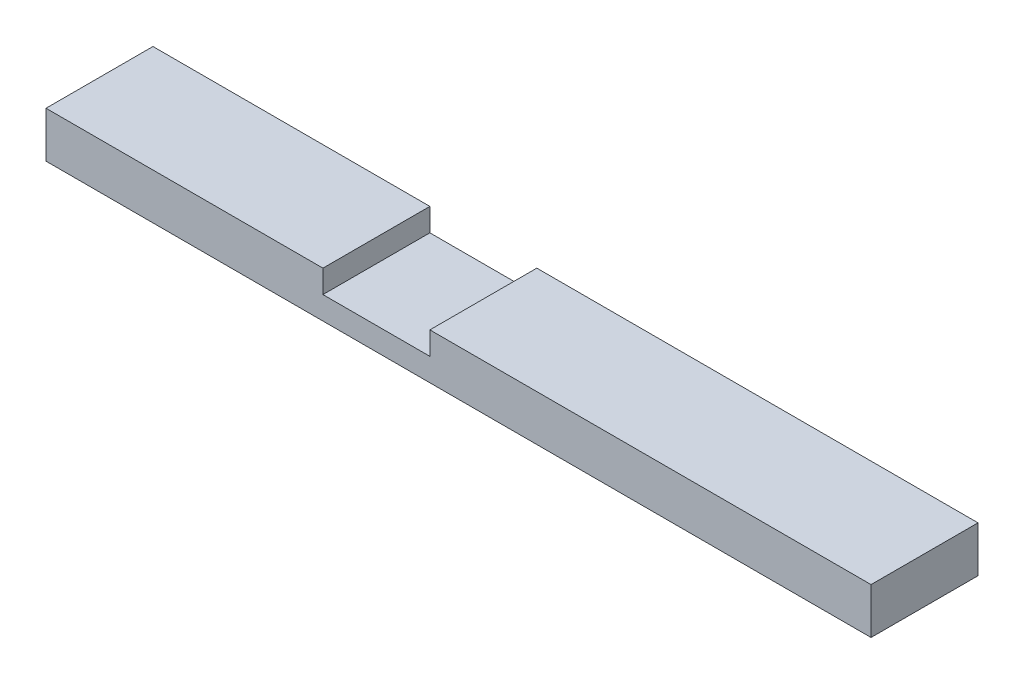
ISO-10303-21;
HEADER;
FILE_DESCRIPTION(('STEP AP214'),'2;1');
FILE_NAME('part.step','',(''),(''),'','','');
FILE_SCHEMA(('AUTOMOTIVE_DESIGN { 1 0 10303 214 1 1 1 1 }'));
ENDSEC;
DATA;
#1=APPLICATION_CONTEXT('core data for automotive mechanical design processes');
#2=APPLICATION_PROTOCOL_DEFINITION('international standard','automotive_design',2000,#1);
#3=PRODUCT_CONTEXT('',#1,'mechanical');
#4=PRODUCT('Part','Part','',(#3));
#5=PRODUCT_RELATED_PRODUCT_CATEGORY('part','',(#4));
#6=PRODUCT_DEFINITION_FORMATION('','',#4);
#7=PRODUCT_DEFINITION_CONTEXT('part definition',#1,'design');
#8=PRODUCT_DEFINITION('design','',#6,#7);
#9=PRODUCT_DEFINITION_SHAPE('','',#8);
#10=(LENGTH_UNIT() NAMED_UNIT(*) SI_UNIT(.MILLI.,.METRE.));
#11=(NAMED_UNIT(*) PLANE_ANGLE_UNIT() SI_UNIT($,.RADIAN.));
#12=(NAMED_UNIT(*) SI_UNIT($,.STERADIAN.) SOLID_ANGLE_UNIT());
#13=UNCERTAINTY_MEASURE_WITH_UNIT(LENGTH_MEASURE(1.E-05),#10,'distance_accuracy_value','');
#14=(GEOMETRIC_REPRESENTATION_CONTEXT(3) GLOBAL_UNCERTAINTY_ASSIGNED_CONTEXT((#13)) GLOBAL_UNIT_ASSIGNED_CONTEXT((#10,
#11,#12)) REPRESENTATION_CONTEXT('',''));
#15=CARTESIAN_POINT('',(0.,0.,0.));
#16=DIRECTION('',(0.,0.,1.));
#17=DIRECTION('',(1.,0.,0.));
#18=AXIS2_PLACEMENT_3D('',#15,#16,#17);
#19=CARTESIAN_POINT('',(0.,38.1,0.));
#20=DIRECTION('',(0.,-1.,0.));
#21=DIRECTION('',(0.,0.,-1.));
#22=AXIS2_PLACEMENT_3D('',#19,#20,#21);
#23=PLANE('',#22);
#24=DIRECTION('',(1.,0.,0.));
#25=VECTOR('',#24,1.);
#26=CARTESIAN_POINT('',(0.,38.1,0.));
#27=LINE('',#26,#25);
#28=CARTESIAN_POINT('',(0.,38.1,0.));
#29=VERTEX_POINT('',#28);
#30=CARTESIAN_POINT('',(230.1875,38.1,0.));
#31=VERTEX_POINT('',#30);
#32=EDGE_CURVE('E92',#29,#31,#27,.T.);
#33=ORIENTED_EDGE('',*,*,#32,.T.);
#34=DIRECTION('',(0.,0.,1.));
#35=VECTOR('',#34,1.);
#36=CARTESIAN_POINT('',(230.1875,38.1,-88.9));
#37=LINE('',#36,#35);
#38=CARTESIAN_POINT('',(230.1875,38.1,-88.9));
#39=VERTEX_POINT('',#38);
#40=EDGE_CURVE('E118',#39,#31,#37,.T.);
#41=ORIENTED_EDGE('',*,*,#40,.F.);
#42=DIRECTION('',(-1.,0.,0.));
#43=VECTOR('',#42,1.);
#44=CARTESIAN_POINT('',(0.,38.1,-88.9));
#45=LINE('',#44,#43);
#46=CARTESIAN_POINT('',(0.,38.1,-88.9));
#47=VERTEX_POINT('',#46);
#48=EDGE_CURVE('E63',#39,#47,#45,.T.);
#49=ORIENTED_EDGE('',*,*,#48,.T.);
#50=DIRECTION('',(0.,0.,1.));
#51=VECTOR('',#50,1.);
#52=CARTESIAN_POINT('',(0.,38.1,0.));
#53=LINE('',#52,#51);
#54=EDGE_CURVE('E147',#47,#29,#53,.T.);
#55=ORIENTED_EDGE('',*,*,#54,.T.);
#56=EDGE_LOOP('',(#33,#41,#49,#55));
#57=FACE_BOUND('',#56,.T.);
#58=ADVANCED_FACE('F39',(#57),#23,.F.);
#59=CARTESIAN_POINT('',(0.,38.1,0.));
#60=DIRECTION('',(1.,0.,0.));
#61=DIRECTION('',(0.,0.,-1.));
#62=AXIS2_PLACEMENT_3D('',#59,#60,#61);
#63=PLANE('',#62);
#64=DIRECTION('',(0.,0.,1.));
#65=VECTOR('',#64,1.);
#66=CARTESIAN_POINT('',(0.,0.,0.));
#67=LINE('',#66,#65);
#68=CARTESIAN_POINT('',(0.,0.,-88.9));
#69=VERTEX_POINT('',#68);
#70=CARTESIAN_POINT('',(0.,0.,0.));
#71=VERTEX_POINT('',#70);
#72=EDGE_CURVE('E142',#69,#71,#67,.T.);
#73=ORIENTED_EDGE('',*,*,#72,.T.);
#74=DIRECTION('',(0.,-1.,0.));
#75=VECTOR('',#74,1.);
#76=CARTESIAN_POINT('',(0.,38.1,0.));
#77=LINE('',#76,#75);
#78=EDGE_CURVE('E11',#29,#71,#77,.T.);
#79=ORIENTED_EDGE('',*,*,#78,.F.);
#80=ORIENTED_EDGE('',*,*,#54,.F.);
#81=DIRECTION('',(0.,-1.,0.));
#82=VECTOR('',#81,1.);
#83=CARTESIAN_POINT('',(0.,38.1,-88.9));
#84=LINE('',#83,#82);
#85=EDGE_CURVE('E156',#47,#69,#84,.T.);
#86=ORIENTED_EDGE('',*,*,#85,.T.);
#87=EDGE_LOOP('',(#73,#79,#80,#86));
#88=FACE_BOUND('',#87,.T.);
#89=ADVANCED_FACE('F41',(#88),#63,.F.);
#90=CARTESIAN_POINT('',(0.,38.1,0.));
#91=DIRECTION('',(0.,0.,-1.));
#92=DIRECTION('',(-1.,0.,0.));
#93=AXIS2_PLACEMENT_3D('',#90,#91,#92);
#94=PLANE('',#93);
#95=DIRECTION('',(1.,0.,0.));
#96=VECTOR('',#95,1.);
#97=CARTESIAN_POINT('',(230.1875,19.05,0.));
#98=LINE('',#97,#96);
#99=CARTESIAN_POINT('',(230.1875,19.05,0.));
#100=VERTEX_POINT('',#99);
#101=CARTESIAN_POINT('',(319.0875,19.05,0.));
#102=VERTEX_POINT('',#101);
#103=EDGE_CURVE('E126',#100,#102,#98,.T.);
#104=ORIENTED_EDGE('',*,*,#103,.F.);
#105=DIRECTION('',(0.,1.,0.));
#106=VECTOR('',#105,1.);
#107=CARTESIAN_POINT('',(230.1875,19.05,0.));
#108=LINE('',#107,#106);
#109=EDGE_CURVE('E113',#100,#31,#108,.T.);
#110=ORIENTED_EDGE('',*,*,#109,.T.);
#111=ORIENTED_EDGE('',*,*,#32,.F.);
#112=ORIENTED_EDGE('',*,*,#78,.T.);
#113=DIRECTION('',(1.,0.,0.));
#114=VECTOR('',#113,1.);
#115=CARTESIAN_POINT('',(0.,0.,0.));
#116=LINE('',#115,#114);
#117=CARTESIAN_POINT('',(685.8,0.,0.));
#118=VERTEX_POINT('',#117);
#119=EDGE_CURVE('E159',#71,#118,#116,.T.);
#120=ORIENTED_EDGE('',*,*,#119,.T.);
#121=DIRECTION('',(0.,-1.,0.));
#122=VECTOR('',#121,1.);
#123=CARTESIAN_POINT('',(685.8,38.1,0.));
#124=LINE('',#123,#122);
#125=CARTESIAN_POINT('',(685.8,38.1,0.));
#126=VERTEX_POINT('',#125);
#127=EDGE_CURVE('E47',#126,#118,#124,.T.);
#128=ORIENTED_EDGE('',*,*,#127,.F.);
#129=CARTESIAN_POINT('',(319.0875,38.1,0.));
#130=VERTEX_POINT('',#129);
#131=EDGE_CURVE('E149',#130,#126,#27,.T.);
#132=ORIENTED_EDGE('',*,*,#131,.F.);
#133=DIRECTION('',(0.,1.,0.));
#134=VECTOR('',#133,1.);
#135=CARTESIAN_POINT('',(319.0875,19.05,0.));
#136=LINE('',#135,#134);
#137=EDGE_CURVE('E54',#102,#130,#136,.T.);
#138=ORIENTED_EDGE('',*,*,#137,.F.);
#139=EDGE_LOOP('',(#104,#110,#111,#112,#120,#128,#132,#138));
#140=FACE_BOUND('',#139,.T.);
#141=ADVANCED_FACE('F131',(#140),#94,.F.);
#142=CARTESIAN_POINT('',(685.8,38.1,0.));
#143=DIRECTION('',(-1.,0.,0.));
#144=DIRECTION('',(0.,0.,1.));
#145=AXIS2_PLACEMENT_3D('',#142,#143,#144);
#146=PLANE('',#145);
#147=DIRECTION('',(0.,0.,-1.));
#148=VECTOR('',#147,1.);
#149=CARTESIAN_POINT('',(685.8,0.,0.));
#150=LINE('',#149,#148);
#151=CARTESIAN_POINT('',(685.8,0.,-88.9));
#152=VERTEX_POINT('',#151);
#153=EDGE_CURVE('E161',#118,#152,#150,.T.);
#154=ORIENTED_EDGE('',*,*,#153,.T.);
#155=DIRECTION('',(0.,-1.,0.));
#156=VECTOR('',#155,1.);
#157=CARTESIAN_POINT('',(685.8,38.1,-88.9));
#158=LINE('',#157,#156);
#159=CARTESIAN_POINT('',(685.8,38.1,-88.9));
#160=VERTEX_POINT('',#159);
#161=EDGE_CURVE('E165',#160,#152,#158,.T.);
#162=ORIENTED_EDGE('',*,*,#161,.F.);
#163=DIRECTION('',(0.,0.,-1.));
#164=VECTOR('',#163,1.);
#165=CARTESIAN_POINT('',(685.8,38.1,0.));
#166=LINE('',#165,#164);
#167=EDGE_CURVE('E151',#126,#160,#166,.T.);
#168=ORIENTED_EDGE('',*,*,#167,.F.);
#169=ORIENTED_EDGE('',*,*,#127,.T.);
#170=EDGE_LOOP('',(#154,#162,#168,#169));
#171=FACE_BOUND('',#170,.T.);
#172=ADVANCED_FACE('F171',(#171),#146,.F.);
#173=CARTESIAN_POINT('',(0.,38.1,-88.9));
#174=DIRECTION('',(0.,0.,1.));
#175=DIRECTION('',(1.,0.,0.));
#176=AXIS2_PLACEMENT_3D('',#173,#174,#175);
#177=PLANE('',#176);
#178=ORIENTED_EDGE('',*,*,#48,.F.);
#179=DIRECTION('',(0.,1.,0.));
#180=VECTOR('',#179,1.);
#181=CARTESIAN_POINT('',(230.1875,19.05,-88.9));
#182=LINE('',#181,#180);
#183=CARTESIAN_POINT('',(230.1875,19.05,-88.9));
#184=VERTEX_POINT('',#183);
#185=EDGE_CURVE('E140',#184,#39,#182,.T.);
#186=ORIENTED_EDGE('',*,*,#185,.F.);
#187=DIRECTION('',(-1.,0.,0.));
#188=VECTOR('',#187,1.);
#189=CARTESIAN_POINT('',(230.1875,19.05,-88.9));
#190=LINE('',#189,#188);
#191=CARTESIAN_POINT('',(319.0875,19.05,-88.9));
#192=VERTEX_POINT('',#191);
#193=EDGE_CURVE('E120',#192,#184,#190,.T.);
#194=ORIENTED_EDGE('',*,*,#193,.F.);
#195=DIRECTION('',(0.,1.,0.));
#196=VECTOR('',#195,1.);
#197=CARTESIAN_POINT('',(319.0875,19.05,-88.9));
#198=LINE('',#197,#196);
#199=CARTESIAN_POINT('',(319.0875,38.1,-88.9));
#200=VERTEX_POINT('',#199);
#201=EDGE_CURVE('E143',#192,#200,#198,.T.);
#202=ORIENTED_EDGE('',*,*,#201,.T.);
#203=EDGE_CURVE('E153',#160,#200,#45,.T.);
#204=ORIENTED_EDGE('',*,*,#203,.F.);
#205=ORIENTED_EDGE('',*,*,#161,.T.);
#206=DIRECTION('',(-1.,0.,0.));
#207=VECTOR('',#206,1.);
#208=CARTESIAN_POINT('',(0.,0.,-88.9));
#209=LINE('',#208,#207);
#210=EDGE_CURVE('E85',#152,#69,#209,.T.);
#211=ORIENTED_EDGE('',*,*,#210,.T.);
#212=ORIENTED_EDGE('',*,*,#85,.F.);
#213=EDGE_LOOP('',(#178,#186,#194,#202,#204,#205,#211,#212));
#214=FACE_BOUND('',#213,.T.);
#215=ADVANCED_FACE('F179',(#214),#177,.F.);
#216=ORIENTED_EDGE('',*,*,#203,.T.);
#217=DIRECTION('',(0.,0.,-1.));
#218=VECTOR('',#217,1.);
#219=CARTESIAN_POINT('',(319.0875,38.1,-88.9));
#220=LINE('',#219,#218);
#221=EDGE_CURVE('E129',#130,#200,#220,.T.);
#222=ORIENTED_EDGE('',*,*,#221,.F.);
#223=ORIENTED_EDGE('',*,*,#131,.T.);
#224=ORIENTED_EDGE('',*,*,#167,.T.);
#225=EDGE_LOOP('',(#216,#222,#223,#224));
#226=FACE_BOUND('',#225,.T.);
#227=ADVANCED_FACE('F182',(#226),#23,.F.);
#228=CARTESIAN_POINT('',(0.,0.,0.));
#229=DIRECTION('',(0.,-1.,0.));
#230=DIRECTION('',(0.,0.,-1.));
#231=AXIS2_PLACEMENT_3D('',#228,#229,#230);
#232=PLANE('',#231);
#233=ORIENTED_EDGE('',*,*,#72,.F.);
#234=ORIENTED_EDGE('',*,*,#210,.F.);
#235=ORIENTED_EDGE('',*,*,#153,.F.);
#236=ORIENTED_EDGE('',*,*,#119,.F.);
#237=EDGE_LOOP('',(#233,#234,#235,#236));
#238=FACE_BOUND('',#237,.T.);
#239=ADVANCED_FACE('F175',(#238),#232,.T.);
#240=CARTESIAN_POINT('',(230.1875,19.05,-88.9));
#241=DIRECTION('',(-1.,0.,0.));
#242=DIRECTION('',(0.,0.,1.));
#243=AXIS2_PLACEMENT_3D('',#240,#241,#242);
#244=PLANE('',#243);
#245=ORIENTED_EDGE('',*,*,#40,.T.);
#246=ORIENTED_EDGE('',*,*,#109,.F.);
#247=DIRECTION('',(0.,0.,1.));
#248=VECTOR('',#247,1.);
#249=CARTESIAN_POINT('',(230.1875,19.05,-88.9));
#250=LINE('',#249,#248);
#251=EDGE_CURVE('E116',#184,#100,#250,.T.);
#252=ORIENTED_EDGE('',*,*,#251,.F.);
#253=ORIENTED_EDGE('',*,*,#185,.T.);
#254=EDGE_LOOP('',(#245,#246,#252,#253));
#255=FACE_BOUND('',#254,.T.);
#256=ADVANCED_FACE('F115',(#255),#244,.F.);
#257=CARTESIAN_POINT('',(319.0875,19.05,-88.9));
#258=DIRECTION('',(1.,0.,0.));
#259=DIRECTION('',(0.,0.,-1.));
#260=AXIS2_PLACEMENT_3D('',#257,#258,#259);
#261=PLANE('',#260);
#262=ORIENTED_EDGE('',*,*,#221,.T.);
#263=ORIENTED_EDGE('',*,*,#201,.F.);
#264=DIRECTION('',(0.,0.,-1.));
#265=VECTOR('',#264,1.);
#266=CARTESIAN_POINT('',(319.0875,19.05,-88.9));
#267=LINE('',#266,#265);
#268=EDGE_CURVE('E133',#102,#192,#267,.T.);
#269=ORIENTED_EDGE('',*,*,#268,.F.);
#270=ORIENTED_EDGE('',*,*,#137,.T.);
#271=EDGE_LOOP('',(#262,#263,#269,#270));
#272=FACE_BOUND('',#271,.T.);
#273=ADVANCED_FACE('F198',(#272),#261,.F.);
#274=CARTESIAN_POINT('',(0.,19.05,0.));
#275=DIRECTION('',(0.,1.,0.));
#276=DIRECTION('',(0.,0.,1.));
#277=AXIS2_PLACEMENT_3D('',#274,#275,#276);
#278=PLANE('',#277);
#279=ORIENTED_EDGE('',*,*,#251,.T.);
#280=ORIENTED_EDGE('',*,*,#103,.T.);
#281=ORIENTED_EDGE('',*,*,#268,.T.);
#282=ORIENTED_EDGE('',*,*,#193,.T.);
#283=EDGE_LOOP('',(#279,#280,#281,#282));
#284=FACE_BOUND('',#283,.T.);
#285=ADVANCED_FACE('F124',(#284),#278,.T.);
#286=CLOSED_SHELL('',(#58,#89,#141,#172,#215,#227,#239,#256,#273,#285));
#287=MANIFOLD_SOLID_BREP('B2',#286);
#288=ADVANCED_BREP_SHAPE_REPRESENTATION('',(#18,#287),#14);
#289=SHAPE_DEFINITION_REPRESENTATION(#9,#288);
ENDSEC;
END-ISO-10303-21;
